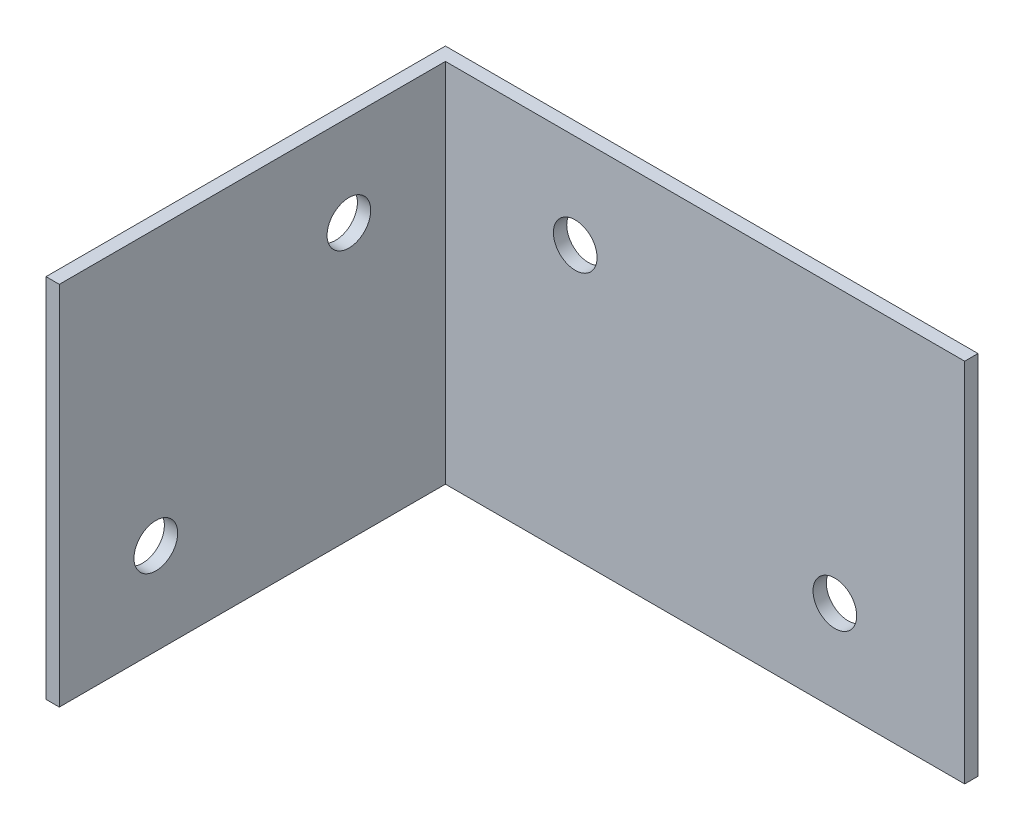
ISO-10303-21;
HEADER;
FILE_DESCRIPTION(('STEP AP214'),'2;1');
FILE_NAME('part.step','',(''),(''),'','','');
FILE_SCHEMA(('AUTOMOTIVE_DESIGN { 1 0 10303 214 1 1 1 1 }'));
ENDSEC;
DATA;
#1=APPLICATION_CONTEXT('core data for automotive mechanical design processes');
#2=APPLICATION_PROTOCOL_DEFINITION('international standard','automotive_design',2000,#1);
#3=PRODUCT_CONTEXT('',#1,'mechanical');
#4=PRODUCT('Part','Part','',(#3));
#5=PRODUCT_RELATED_PRODUCT_CATEGORY('part','',(#4));
#6=PRODUCT_DEFINITION_FORMATION('','',#4);
#7=PRODUCT_DEFINITION_CONTEXT('part definition',#1,'design');
#8=PRODUCT_DEFINITION('design','',#6,#7);
#9=PRODUCT_DEFINITION_SHAPE('','',#8);
#10=(LENGTH_UNIT() NAMED_UNIT(*) SI_UNIT(.MILLI.,.METRE.));
#11=(NAMED_UNIT(*) PLANE_ANGLE_UNIT() SI_UNIT($,.RADIAN.));
#12=(NAMED_UNIT(*) SI_UNIT($,.STERADIAN.) SOLID_ANGLE_UNIT());
#13=UNCERTAINTY_MEASURE_WITH_UNIT(LENGTH_MEASURE(1.E-05),#10,'distance_accuracy_value','');
#14=(GEOMETRIC_REPRESENTATION_CONTEXT(3) GLOBAL_UNCERTAINTY_ASSIGNED_CONTEXT((#13)) GLOBAL_UNIT_ASSIGNED_CONTEXT((#10,
#11,#12)) REPRESENTATION_CONTEXT('',''));
#15=CARTESIAN_POINT('',(0.,0.,0.));
#16=DIRECTION('',(0.,0.,1.));
#17=DIRECTION('',(1.,0.,0.));
#18=AXIS2_PLACEMENT_3D('',#15,#16,#17);
#19=CARTESIAN_POINT('',(-25.4,17.4625,1.27));
#20=DIRECTION('',(1.,0.,0.));
#21=DIRECTION('',(0.,1.,0.));
#22=AXIS2_PLACEMENT_3D('',#19,#20,#21);
#23=PLANE('',#22);
#24=CARTESIAN_POINT('',(-25.4,8.73124999999999,10.4775));
#25=DIRECTION('',(1.,0.,0.));
#26=DIRECTION('',(0.,1.,0.));
#27=AXIS2_PLACEMENT_3D('',#24,#25,#26);
#28=CIRCLE('',#27,2.0828);
#29=CARTESIAN_POINT('',(-25.4,10.81405,10.4775));
#30=VERTEX_POINT('',#29);
#31=EDGE_CURVE('E173',#30,#30,#28,.T.);
#32=ORIENTED_EDGE('',*,*,#31,.T.);
#33=EDGE_LOOP('',(#32));
#34=FACE_BOUND('',#33,.T.);
#35=CARTESIAN_POINT('',(-25.4,-8.73125,28.8925));
#36=DIRECTION('',(1.,0.,0.));
#37=DIRECTION('',(0.,1.,0.));
#38=AXIS2_PLACEMENT_3D('',#35,#36,#37);
#39=CIRCLE('',#38,2.0828);
#40=CARTESIAN_POINT('',(-25.4,-6.64845,28.8925));
#41=VERTEX_POINT('',#40);
#42=EDGE_CURVE('E166',#41,#41,#39,.T.);
#43=ORIENTED_EDGE('',*,*,#42,.T.);
#44=EDGE_LOOP('',(#43));
#45=FACE_BOUND('',#44,.T.);
#46=DIRECTION('',(0.,-1.,0.));
#47=VECTOR('',#46,1.);
#48=CARTESIAN_POINT('',(-25.4,17.4625,0.));
#49=LINE('',#48,#47);
#50=CARTESIAN_POINT('',(-25.4,17.4625,0.));
#51=VERTEX_POINT('',#50);
#52=CARTESIAN_POINT('',(-25.4,-17.4625,0.));
#53=VERTEX_POINT('',#52);
#54=EDGE_CURVE('E122',#51,#53,#49,.T.);
#55=ORIENTED_EDGE('',*,*,#54,.T.);
#56=DIRECTION('',(0.,0.,-1.));
#57=VECTOR('',#56,1.);
#58=CARTESIAN_POINT('',(-25.4,-17.4625,1.27));
#59=LINE('',#58,#57);
#60=CARTESIAN_POINT('',(-25.4,-17.4625,38.1));
#61=VERTEX_POINT('',#60);
#62=EDGE_CURVE('E13',#61,#53,#59,.T.);
#63=ORIENTED_EDGE('',*,*,#62,.F.);
#64=DIRECTION('',(0.,-1.,0.));
#65=VECTOR('',#64,1.);
#66=CARTESIAN_POINT('',(-25.4,17.4625,38.1));
#67=LINE('',#66,#65);
#68=CARTESIAN_POINT('',(-25.4,17.4625,38.1));
#69=VERTEX_POINT('',#68);
#70=EDGE_CURVE('E124',#69,#61,#67,.T.);
#71=ORIENTED_EDGE('',*,*,#70,.F.);
#72=DIRECTION('',(0.,0.,-1.));
#73=VECTOR('',#72,1.);
#74=CARTESIAN_POINT('',(-25.4,17.4625,1.27));
#75=LINE('',#74,#73);
#76=EDGE_CURVE('E108',#69,#51,#75,.T.);
#77=ORIENTED_EDGE('',*,*,#76,.T.);
#78=EDGE_LOOP('',(#55,#63,#71,#77));
#79=FACE_BOUND('',#78,.T.);
#80=ADVANCED_FACE('F54',(#34,#45,#79),#23,.F.);
#81=CARTESIAN_POINT('',(25.4,-17.4625,1.27));
#82=DIRECTION('',(0.,1.,0.));
#83=DIRECTION('',(-1.,0.,0.));
#84=AXIS2_PLACEMENT_3D('',#81,#82,#83);
#85=PLANE('',#84);
#86=DIRECTION('',(1.,0.,0.));
#87=VECTOR('',#86,1.);
#88=CARTESIAN_POINT('',(25.4,-17.4625,0.));
#89=LINE('',#88,#87);
#90=CARTESIAN_POINT('',(25.4,-17.4625,0.));
#91=VERTEX_POINT('',#90);
#92=EDGE_CURVE('E130',#53,#91,#89,.T.);
#93=ORIENTED_EDGE('',*,*,#92,.T.);
#94=DIRECTION('',(0.,0.,-1.));
#95=VECTOR('',#94,1.);
#96=CARTESIAN_POINT('',(25.4,-17.4625,1.27));
#97=LINE('',#96,#95);
#98=CARTESIAN_POINT('',(25.4,-17.4625,1.27));
#99=VERTEX_POINT('',#98);
#100=EDGE_CURVE('E63',#99,#91,#97,.T.);
#101=ORIENTED_EDGE('',*,*,#100,.F.);
#102=DIRECTION('',(1.,0.,0.));
#103=VECTOR('',#102,1.);
#104=CARTESIAN_POINT('',(25.4,-17.4625,1.27));
#105=LINE('',#104,#103);
#106=CARTESIAN_POINT('',(-24.13,-17.4625,1.27));
#107=VERTEX_POINT('',#106);
#108=EDGE_CURVE('E116',#107,#99,#105,.T.);
#109=ORIENTED_EDGE('',*,*,#108,.F.);
#110=DIRECTION('',(0.,0.,-1.));
#111=VECTOR('',#110,1.);
#112=CARTESIAN_POINT('',(-24.13,-17.4625,38.1));
#113=LINE('',#112,#111);
#114=CARTESIAN_POINT('',(-24.13,-17.4625,38.1));
#115=VERTEX_POINT('',#114);
#116=EDGE_CURVE('E71',#115,#107,#113,.T.);
#117=ORIENTED_EDGE('',*,*,#116,.F.);
#118=DIRECTION('',(1.,0.,0.));
#119=VECTOR('',#118,1.);
#120=CARTESIAN_POINT('',(-25.4,-17.4625,38.1));
#121=LINE('',#120,#119);
#122=EDGE_CURVE('E178',#61,#115,#121,.T.);
#123=ORIENTED_EDGE('',*,*,#122,.F.);
#124=ORIENTED_EDGE('',*,*,#62,.T.);
#125=EDGE_LOOP('',(#93,#101,#109,#117,#123,#124));
#126=FACE_BOUND('',#125,.T.);
#127=ADVANCED_FACE('F218',(#126),#85,.F.);
#128=CARTESIAN_POINT('',(25.4,17.4625,1.27));
#129=DIRECTION('',(-1.,0.,0.));
#130=DIRECTION('',(0.,0.,1.));
#131=AXIS2_PLACEMENT_3D('',#128,#129,#130);
#132=PLANE('',#131);
#133=DIRECTION('',(0.,1.,0.));
#134=VECTOR('',#133,1.);
#135=CARTESIAN_POINT('',(25.4,17.4625,0.));
#136=LINE('',#135,#134);
#137=CARTESIAN_POINT('',(25.4,17.4625,0.));
#138=VERTEX_POINT('',#137);
#139=EDGE_CURVE('E117',#91,#138,#136,.T.);
#140=ORIENTED_EDGE('',*,*,#139,.T.);
#141=DIRECTION('',(0.,0.,-1.));
#142=VECTOR('',#141,1.);
#143=CARTESIAN_POINT('',(25.4,17.4625,1.27));
#144=LINE('',#143,#142);
#145=CARTESIAN_POINT('',(25.4,17.4625,1.27));
#146=VERTEX_POINT('',#145);
#147=EDGE_CURVE('E111',#146,#138,#144,.T.);
#148=ORIENTED_EDGE('',*,*,#147,.F.);
#149=DIRECTION('',(0.,1.,0.));
#150=VECTOR('',#149,1.);
#151=CARTESIAN_POINT('',(25.4,17.4625,1.27));
#152=LINE('',#151,#150);
#153=EDGE_CURVE('E80',#99,#146,#152,.T.);
#154=ORIENTED_EDGE('',*,*,#153,.F.);
#155=ORIENTED_EDGE('',*,*,#100,.T.);
#156=EDGE_LOOP('',(#140,#148,#154,#155));
#157=FACE_BOUND('',#156,.T.);
#158=ADVANCED_FACE('F223',(#157),#132,.F.);
#159=CARTESIAN_POINT('',(25.4,17.4625,1.27));
#160=DIRECTION('',(0.,-1.,0.));
#161=DIRECTION('',(1.,0.,0.));
#162=AXIS2_PLACEMENT_3D('',#159,#160,#161);
#163=PLANE('',#162);
#164=DIRECTION('',(-1.,0.,0.));
#165=VECTOR('',#164,1.);
#166=CARTESIAN_POINT('',(25.4,17.4625,0.));
#167=LINE('',#166,#165);
#168=EDGE_CURVE('E103',#138,#51,#167,.T.);
#169=ORIENTED_EDGE('',*,*,#168,.T.);
#170=ORIENTED_EDGE('',*,*,#76,.F.);
#171=DIRECTION('',(1.,0.,0.));
#172=VECTOR('',#171,1.);
#173=CARTESIAN_POINT('',(-25.4,17.4625,38.1));
#174=LINE('',#173,#172);
#175=CARTESIAN_POINT('',(-24.13,17.4625,38.1));
#176=VERTEX_POINT('',#175);
#177=EDGE_CURVE('E184',#69,#176,#174,.T.);
#178=ORIENTED_EDGE('',*,*,#177,.T.);
#179=DIRECTION('',(0.,0.,-1.));
#180=VECTOR('',#179,1.);
#181=CARTESIAN_POINT('',(-24.13,17.4625,38.1));
#182=LINE('',#181,#180);
#183=CARTESIAN_POINT('',(-24.13,17.4625,1.27));
#184=VERTEX_POINT('',#183);
#185=EDGE_CURVE('E137',#176,#184,#182,.T.);
#186=ORIENTED_EDGE('',*,*,#185,.T.);
#187=DIRECTION('',(-1.,0.,0.));
#188=VECTOR('',#187,1.);
#189=CARTESIAN_POINT('',(25.4,17.4625,1.27));
#190=LINE('',#189,#188);
#191=EDGE_CURVE('E127',#146,#184,#190,.T.);
#192=ORIENTED_EDGE('',*,*,#191,.F.);
#193=ORIENTED_EDGE('',*,*,#147,.T.);
#194=EDGE_LOOP('',(#169,#170,#178,#186,#192,#193));
#195=FACE_BOUND('',#194,.T.);
#196=ADVANCED_FACE('F105',(#195),#163,.F.);
#197=CARTESIAN_POINT('',(0.,0.,1.27));
#198=DIRECTION('',(0.,0.,-1.));
#199=DIRECTION('',(-1.,0.,0.));
#200=AXIS2_PLACEMENT_3D('',#197,#198,#199);
#201=PLANE('',#200);
#202=CARTESIAN_POINT('',(-11.7475,8.47725,1.27));
#203=DIRECTION('',(0.,0.,1.));
#204=DIRECTION('',(1.,0.,0.));
#205=AXIS2_PLACEMENT_3D('',#202,#203,#204);
#206=CIRCLE('',#205,2.0828);
#207=CARTESIAN_POINT('',(-9.6647,8.47725,1.27));
#208=VERTEX_POINT('',#207);
#209=EDGE_CURVE('E147',#208,#208,#206,.T.);
#210=ORIENTED_EDGE('',*,*,#209,.F.);
#211=EDGE_LOOP('',(#210));
#212=FACE_BOUND('',#211,.T.);
#213=CARTESIAN_POINT('',(13.0175,-8.73125,1.27));
#214=DIRECTION('',(0.,0.,1.));
#215=DIRECTION('',(1.,0.,0.));
#216=AXIS2_PLACEMENT_3D('',#213,#214,#215);
#217=CIRCLE('',#216,2.0828);
#218=CARTESIAN_POINT('',(15.1003,-8.73125,1.27));
#219=VERTEX_POINT('',#218);
#220=EDGE_CURVE('E155',#219,#219,#217,.T.);
#221=ORIENTED_EDGE('',*,*,#220,.F.);
#222=EDGE_LOOP('',(#221));
#223=FACE_BOUND('',#222,.T.);
#224=ORIENTED_EDGE('',*,*,#191,.T.);
#225=DIRECTION('',(0.,-1.,0.));
#226=VECTOR('',#225,1.);
#227=CARTESIAN_POINT('',(-24.13,17.4625,1.27));
#228=LINE('',#227,#226);
#229=EDGE_CURVE('E177',#184,#107,#228,.T.);
#230=ORIENTED_EDGE('',*,*,#229,.T.);
#231=ORIENTED_EDGE('',*,*,#108,.T.);
#232=ORIENTED_EDGE('',*,*,#153,.T.);
#233=EDGE_LOOP('',(#224,#230,#231,#232));
#234=FACE_BOUND('',#233,.T.);
#235=ADVANCED_FACE('F194',(#212,#223,#234),#201,.F.);
#236=CARTESIAN_POINT('',(0.,0.,0.));
#237=DIRECTION('',(0.,0.,-1.));
#238=DIRECTION('',(-1.,0.,0.));
#239=AXIS2_PLACEMENT_3D('',#236,#237,#238);
#240=PLANE('',#239);
#241=CARTESIAN_POINT('',(-11.7475,8.47725,0.));
#242=DIRECTION('',(0.,0.,-1.));
#243=DIRECTION('',(-1.,0.,0.));
#244=AXIS2_PLACEMENT_3D('',#241,#242,#243);
#245=CIRCLE('',#244,2.0828);
#246=CARTESIAN_POINT('',(-13.8303,8.47725,0.));
#247=VERTEX_POINT('',#246);
#248=EDGE_CURVE('E57',#247,#247,#245,.T.);
#249=ORIENTED_EDGE('',*,*,#248,.F.);
#250=EDGE_LOOP('',(#249));
#251=FACE_BOUND('',#250,.T.);
#252=CARTESIAN_POINT('',(13.0175,-8.73125,0.));
#253=DIRECTION('',(0.,0.,-1.));
#254=DIRECTION('',(-1.,0.,0.));
#255=AXIS2_PLACEMENT_3D('',#252,#253,#254);
#256=CIRCLE('',#255,2.0828);
#257=CARTESIAN_POINT('',(10.9347,-8.73125,0.));
#258=VERTEX_POINT('',#257);
#259=EDGE_CURVE('E145',#258,#258,#256,.T.);
#260=ORIENTED_EDGE('',*,*,#259,.F.);
#261=EDGE_LOOP('',(#260));
#262=FACE_BOUND('',#261,.T.);
#263=ORIENTED_EDGE('',*,*,#54,.F.);
#264=ORIENTED_EDGE('',*,*,#168,.F.);
#265=ORIENTED_EDGE('',*,*,#139,.F.);
#266=ORIENTED_EDGE('',*,*,#92,.F.);
#267=EDGE_LOOP('',(#263,#264,#265,#266));
#268=FACE_BOUND('',#267,.T.);
#269=ADVANCED_FACE('F129',(#251,#262,#268),#240,.T.);
#270=CARTESIAN_POINT('',(-24.13,17.4625,38.1));
#271=DIRECTION('',(1.,0.,0.));
#272=DIRECTION('',(0.,1.,0.));
#273=AXIS2_PLACEMENT_3D('',#270,#271,#272);
#274=PLANE('',#273);
#275=CARTESIAN_POINT('',(-24.13,8.73124999999999,10.4775));
#276=DIRECTION('',(1.,0.,0.));
#277=DIRECTION('',(0.,1.,0.));
#278=AXIS2_PLACEMENT_3D('',#275,#276,#277);
#279=CIRCLE('',#278,2.0828);
#280=CARTESIAN_POINT('',(-24.13,10.81405,10.4775));
#281=VERTEX_POINT('',#280);
#282=EDGE_CURVE('E162',#281,#281,#279,.T.);
#283=ORIENTED_EDGE('',*,*,#282,.F.);
#284=EDGE_LOOP('',(#283));
#285=FACE_BOUND('',#284,.T.);
#286=CARTESIAN_POINT('',(-24.13,-8.73125,28.8925));
#287=DIRECTION('',(1.,0.,0.));
#288=DIRECTION('',(0.,1.,0.));
#289=AXIS2_PLACEMENT_3D('',#286,#287,#288);
#290=CIRCLE('',#289,2.0828);
#291=CARTESIAN_POINT('',(-24.13,-6.64845,28.8925));
#292=VERTEX_POINT('',#291);
#293=EDGE_CURVE('E152',#292,#292,#290,.T.);
#294=ORIENTED_EDGE('',*,*,#293,.F.);
#295=EDGE_LOOP('',(#294));
#296=FACE_BOUND('',#295,.T.);
#297=ORIENTED_EDGE('',*,*,#229,.F.);
#298=ORIENTED_EDGE('',*,*,#185,.F.);
#299=DIRECTION('',(0.,-1.,0.));
#300=VECTOR('',#299,1.);
#301=CARTESIAN_POINT('',(-24.13,17.4625,38.1));
#302=LINE('',#301,#300);
#303=EDGE_CURVE('E182',#176,#115,#302,.T.);
#304=ORIENTED_EDGE('',*,*,#303,.T.);
#305=ORIENTED_EDGE('',*,*,#116,.T.);
#306=EDGE_LOOP('',(#297,#298,#304,#305));
#307=FACE_BOUND('',#306,.T.);
#308=ADVANCED_FACE('F200',(#285,#296,#307),#274,.T.);
#309=CARTESIAN_POINT('',(0.,0.,38.1));
#310=DIRECTION('',(0.,0.,-1.));
#311=DIRECTION('',(-1.,0.,0.));
#312=AXIS2_PLACEMENT_3D('',#309,#310,#311);
#313=PLANE('',#312);
#314=ORIENTED_EDGE('',*,*,#122,.T.);
#315=ORIENTED_EDGE('',*,*,#303,.F.);
#316=ORIENTED_EDGE('',*,*,#177,.F.);
#317=ORIENTED_EDGE('',*,*,#70,.T.);
#318=EDGE_LOOP('',(#314,#315,#316,#317));
#319=FACE_BOUND('',#318,.T.);
#320=ADVANCED_FACE('F202',(#319),#313,.F.);
#321=CARTESIAN_POINT('',(-60.96,-8.73125,28.8925));
#322=DIRECTION('',(1.,0.,0.));
#323=DIRECTION('',(0.,1.,0.));
#324=AXIS2_PLACEMENT_3D('',#321,#322,#323);
#325=CYLINDRICAL_SURFACE('',#324,2.0828);
#326=ORIENTED_EDGE('',*,*,#293,.T.);
#327=EDGE_LOOP('',(#326));
#328=FACE_BOUND('',#327,.T.);
#329=ORIENTED_EDGE('',*,*,#42,.F.);
#330=EDGE_LOOP('',(#329));
#331=FACE_BOUND('',#330,.T.);
#332=ADVANCED_FACE('F209',(#328,#331),#325,.F.);
#333=CARTESIAN_POINT('',(-60.96,8.73124999999999,10.4775));
#334=DIRECTION('',(1.,0.,0.));
#335=DIRECTION('',(0.,1.,0.));
#336=AXIS2_PLACEMENT_3D('',#333,#334,#335);
#337=CYLINDRICAL_SURFACE('',#336,2.0828);
#338=ORIENTED_EDGE('',*,*,#282,.T.);
#339=EDGE_LOOP('',(#338));
#340=FACE_BOUND('',#339,.T.);
#341=ORIENTED_EDGE('',*,*,#31,.F.);
#342=EDGE_LOOP('',(#341));
#343=FACE_BOUND('',#342,.T.);
#344=ADVANCED_FACE('F230',(#340,#343),#337,.F.);
#345=CARTESIAN_POINT('',(13.0175,-8.73125,-35.56));
#346=DIRECTION('',(0.,0.,1.));
#347=DIRECTION('',(1.,0.,0.));
#348=AXIS2_PLACEMENT_3D('',#345,#346,#347);
#349=CYLINDRICAL_SURFACE('',#348,2.0828);
#350=ORIENTED_EDGE('',*,*,#259,.T.);
#351=EDGE_LOOP('',(#350));
#352=FACE_BOUND('',#351,.T.);
#353=ORIENTED_EDGE('',*,*,#220,.T.);
#354=EDGE_LOOP('',(#353));
#355=FACE_BOUND('',#354,.T.);
#356=ADVANCED_FACE('F236',(#352,#355),#349,.F.);
#357=CARTESIAN_POINT('',(-11.7475,8.47725,-35.56));
#358=DIRECTION('',(0.,0.,1.));
#359=DIRECTION('',(1.,0.,0.));
#360=AXIS2_PLACEMENT_3D('',#357,#358,#359);
#361=CYLINDRICAL_SURFACE('',#360,2.0828);
#362=ORIENTED_EDGE('',*,*,#248,.T.);
#363=EDGE_LOOP('',(#362));
#364=FACE_BOUND('',#363,.T.);
#365=ORIENTED_EDGE('',*,*,#209,.T.);
#366=EDGE_LOOP('',(#365));
#367=FACE_BOUND('',#366,.T.);
#368=ADVANCED_FACE('F242',(#364,#367),#361,.F.);
#369=CLOSED_SHELL('',(#80,#127,#158,#196,#235,#269,#308,#320,#332,#344,#356,#368));
#370=MANIFOLD_SOLID_BREP('B2',#369);
#371=ADVANCED_BREP_SHAPE_REPRESENTATION('',(#18,#370),#14);
#372=SHAPE_DEFINITION_REPRESENTATION(#9,#371);
ENDSEC;
END-ISO-10303-21;
